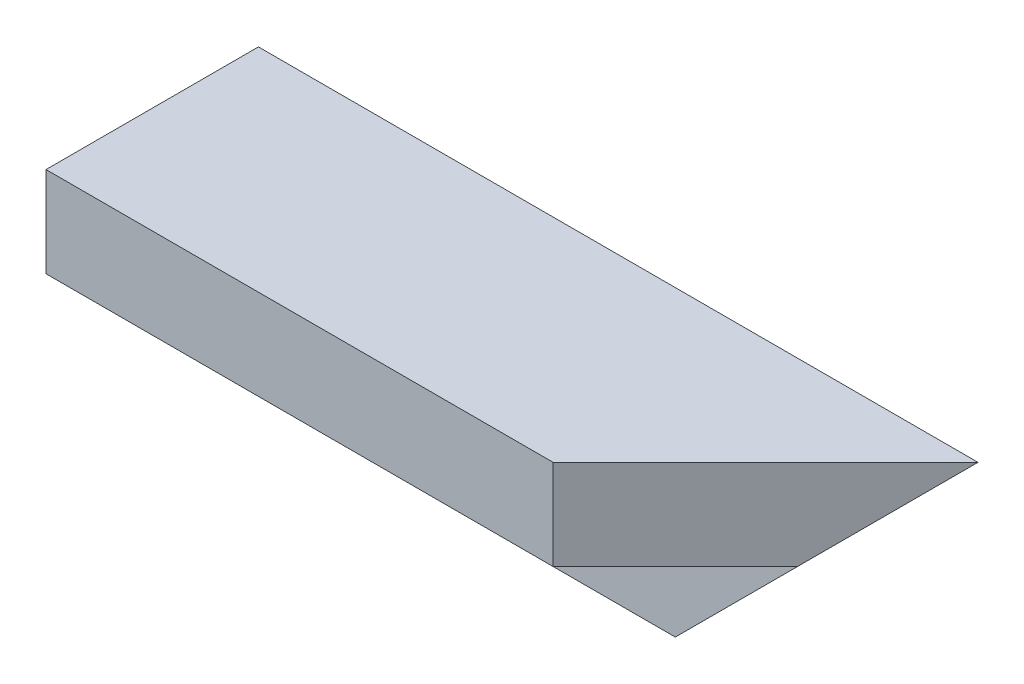
ISO-10303-21;
HEADER;
FILE_DESCRIPTION(('STEP AP214'),'2;1');
FILE_NAME('part.step','',(''),(''),'','','');
FILE_SCHEMA(('AUTOMOTIVE_DESIGN { 1 0 10303 214 1 1 1 1 }'));
ENDSEC;
DATA;
#1=APPLICATION_CONTEXT('core data for automotive mechanical design processes');
#2=APPLICATION_PROTOCOL_DEFINITION('international standard','automotive_design',2000,#1);
#3=PRODUCT_CONTEXT('',#1,'mechanical');
#4=PRODUCT('Part','Part','',(#3));
#5=PRODUCT_RELATED_PRODUCT_CATEGORY('part','',(#4));
#6=PRODUCT_DEFINITION_FORMATION('','',#4);
#7=PRODUCT_DEFINITION_CONTEXT('part definition',#1,'design');
#8=PRODUCT_DEFINITION('design','',#6,#7);
#9=PRODUCT_DEFINITION_SHAPE('','',#8);
#10=(LENGTH_UNIT() NAMED_UNIT(*) SI_UNIT(.MILLI.,.METRE.));
#11=(NAMED_UNIT(*) PLANE_ANGLE_UNIT() SI_UNIT($,.RADIAN.));
#12=(NAMED_UNIT(*) SI_UNIT($,.STERADIAN.) SOLID_ANGLE_UNIT());
#13=UNCERTAINTY_MEASURE_WITH_UNIT(LENGTH_MEASURE(1.E-05),#10,'distance_accuracy_value','');
#14=(GEOMETRIC_REPRESENTATION_CONTEXT(3) GLOBAL_UNCERTAINTY_ASSIGNED_CONTEXT((#13)) GLOBAL_UNIT_ASSIGNED_CONTEXT((#10,
#11,#12)) REPRESENTATION_CONTEXT('',''));
#15=CARTESIAN_POINT('',(0.,0.,0.));
#16=DIRECTION('',(0.,0.,1.));
#17=DIRECTION('',(1.,0.,0.));
#18=AXIS2_PLACEMENT_3D('',#15,#16,#17);
#19=CARTESIAN_POINT('',(222.000000000001,-40.,0.));
#20=DIRECTION('',(0.,0.,1.));
#21=DIRECTION('',(1.,0.,0.));
#22=AXIS2_PLACEMENT_3D('',#19,#20,#21);
#23=PLANE('',#22);
#24=DIRECTION('',(-1.,0.,0.));
#25=VECTOR('',#24,1.);
#26=CARTESIAN_POINT('',(222.000000000001,0.,0.));
#27=LINE('',#26,#25);
#28=CARTESIAN_POINT('',(222.,0.,0.));
#29=VERTEX_POINT('',#28);
#30=CARTESIAN_POINT('',(86.4999999999614,0.,0.));
#31=VERTEX_POINT('',#30);
#32=EDGE_CURVE('E40',#29,#31,#27,.T.);
#33=ORIENTED_EDGE('',*,*,#32,.F.);
#34=DIRECTION('',(0.707106781186548,0.707106781186547,0.));
#35=VECTOR('',#34,1.);
#36=CARTESIAN_POINT('',(222.,0.,0.));
#37=LINE('',#36,#35);
#38=CARTESIAN_POINT('',(182.,-40.,0.));
#39=VERTEX_POINT('',#38);
#40=EDGE_CURVE('E88',#39,#29,#37,.T.);
#41=ORIENTED_EDGE('',*,*,#40,.F.);
#42=DIRECTION('',(-1.,0.,0.));
#43=VECTOR('',#42,1.);
#44=CARTESIAN_POINT('',(222.000000000001,-40.,0.));
#45=LINE('',#44,#43);
#46=CARTESIAN_POINT('',(86.4999999999614,-40.,0.));
#47=VERTEX_POINT('',#46);
#48=EDGE_CURVE('E47',#39,#47,#45,.T.);
#49=ORIENTED_EDGE('',*,*,#48,.T.);
#50=DIRECTION('',(0.,1.,0.));
#51=VECTOR('',#50,1.);
#52=CARTESIAN_POINT('',(86.4999999999614,-40.,0.));
#53=LINE('',#52,#51);
#54=EDGE_CURVE('E118',#47,#31,#53,.T.);
#55=ORIENTED_EDGE('',*,*,#54,.T.);
#56=EDGE_LOOP('',(#33,#41,#49,#55));
#57=FACE_BOUND('',#56,.T.);
#58=ADVANCED_FACE('F33',(#57),#23,.F.);
#59=CARTESIAN_POINT('',(222.000000000001,0.,0.));
#60=DIRECTION('',(0.,-1.,0.));
#61=DIRECTION('',(0.,0.,-1.));
#62=AXIS2_PLACEMENT_3D('',#59,#60,#61);
#63=PLANE('',#62);
#64=DIRECTION('',(-1.,0.,0.));
#65=VECTOR('',#64,1.);
#66=CARTESIAN_POINT('',(222.000000000001,0.,40.));
#67=LINE('',#66,#65);
#68=CARTESIAN_POINT('',(182.,0.,40.));
#69=VERTEX_POINT('',#68);
#70=CARTESIAN_POINT('',(86.4999999999614,0.,40.));
#71=VERTEX_POINT('',#70);
#72=EDGE_CURVE('E109',#69,#71,#67,.T.);
#73=ORIENTED_EDGE('',*,*,#72,.F.);
#74=DIRECTION('',(-0.707106781186548,0.,0.707106781186547));
#75=VECTOR('',#74,1.);
#76=CARTESIAN_POINT('',(222.,0.,0.));
#77=LINE('',#76,#75);
#78=EDGE_CURVE('E117',#29,#69,#77,.T.);
#79=ORIENTED_EDGE('',*,*,#78,.F.);
#80=ORIENTED_EDGE('',*,*,#32,.T.);
#81=DIRECTION('',(0.,0.,1.));
#82=VECTOR('',#81,1.);
#83=CARTESIAN_POINT('',(86.4999999999614,0.,0.));
#84=LINE('',#83,#82);
#85=EDGE_CURVE('E115',#31,#71,#84,.T.);
#86=ORIENTED_EDGE('',*,*,#85,.T.);
#87=EDGE_LOOP('',(#73,#79,#80,#86));
#88=FACE_BOUND('',#87,.T.);
#89=ADVANCED_FACE('F114',(#88),#63,.F.);
#90=CARTESIAN_POINT('',(222.000000000001,0.,40.));
#91=DIRECTION('',(0.,0.,-1.));
#92=DIRECTION('',(-1.,0.,0.));
#93=AXIS2_PLACEMENT_3D('',#90,#91,#92);
#94=PLANE('',#93);
#95=DIRECTION('',(-1.,0.,0.));
#96=VECTOR('',#95,1.);
#97=CARTESIAN_POINT('',(222.000000000001,-17.,40.));
#98=LINE('',#97,#96);
#99=CARTESIAN_POINT('',(182.,-17.,40.));
#100=VERTEX_POINT('',#99);
#101=CARTESIAN_POINT('',(86.4999999999614,-17.,40.));
#102=VERTEX_POINT('',#101);
#103=EDGE_CURVE('E107',#100,#102,#98,.T.);
#104=ORIENTED_EDGE('',*,*,#103,.F.);
#105=DIRECTION('',(0.,1.,0.));
#106=VECTOR('',#105,1.);
#107=CARTESIAN_POINT('',(182.,-40.,40.));
#108=LINE('',#107,#106);
#109=EDGE_CURVE('E125',#100,#69,#108,.T.);
#110=ORIENTED_EDGE('',*,*,#109,.T.);
#111=ORIENTED_EDGE('',*,*,#72,.T.);
#112=DIRECTION('',(0.,-1.,0.));
#113=VECTOR('',#112,1.);
#114=CARTESIAN_POINT('',(86.4999999999614,0.,40.));
#115=LINE('',#114,#113);
#116=EDGE_CURVE('E122',#71,#102,#115,.T.);
#117=ORIENTED_EDGE('',*,*,#116,.T.);
#118=EDGE_LOOP('',(#104,#110,#111,#117));
#119=FACE_BOUND('',#118,.T.);
#120=ADVANCED_FACE('F153',(#119),#94,.F.);
#121=CARTESIAN_POINT('',(222.000000000001,-17.,40.));
#122=DIRECTION('',(0.,1.,0.));
#123=DIRECTION('',(0.,0.,1.));
#124=AXIS2_PLACEMENT_3D('',#121,#122,#123);
#125=PLANE('',#124);
#126=DIRECTION('',(-1.,0.,0.));
#127=VECTOR('',#126,1.);
#128=CARTESIAN_POINT('',(222.000000000001,-17.,17.));
#129=LINE('',#128,#127);
#130=CARTESIAN_POINT('',(205.,-17.,17.));
#131=VERTEX_POINT('',#130);
#132=CARTESIAN_POINT('',(86.4999999999614,-17.,17.));
#133=VERTEX_POINT('',#132);
#134=EDGE_CURVE('E100',#131,#133,#129,.T.);
#135=ORIENTED_EDGE('',*,*,#134,.F.);
#136=DIRECTION('',(-0.707106781186548,0.,0.707106781186548));
#137=VECTOR('',#136,1.);
#138=CARTESIAN_POINT('',(202.,-17.,19.9999999999997));
#139=LINE('',#138,#137);
#140=EDGE_CURVE('E120',#131,#100,#139,.T.);
#141=ORIENTED_EDGE('',*,*,#140,.T.);
#142=ORIENTED_EDGE('',*,*,#103,.T.);
#143=DIRECTION('',(0.,0.,-1.));
#144=VECTOR('',#143,1.);
#145=CARTESIAN_POINT('',(86.4999999999614,-17.,40.));
#146=LINE('',#145,#144);
#147=EDGE_CURVE('E131',#102,#133,#146,.T.);
#148=ORIENTED_EDGE('',*,*,#147,.T.);
#149=EDGE_LOOP('',(#135,#141,#142,#148));
#150=FACE_BOUND('',#149,.T.);
#151=ADVANCED_FACE('F157',(#150),#125,.F.);
#152=CARTESIAN_POINT('',(222.000000000001,-17.,17.));
#153=DIRECTION('',(0.,0.,-1.));
#154=DIRECTION('',(0.,1.,0.));
#155=AXIS2_PLACEMENT_3D('',#152,#153,#154);
#156=PLANE('',#155);
#157=DIRECTION('',(-1.,0.,0.));
#158=VECTOR('',#157,1.);
#159=CARTESIAN_POINT('',(222.000000000001,-40.,17.));
#160=LINE('',#159,#158);
#161=CARTESIAN_POINT('',(182.,-40.,17.));
#162=VERTEX_POINT('',#161);
#163=CARTESIAN_POINT('',(86.4999999999614,-40.,17.));
#164=VERTEX_POINT('',#163);
#165=EDGE_CURVE('E54',#162,#164,#160,.T.);
#166=ORIENTED_EDGE('',*,*,#165,.F.);
#167=DIRECTION('',(0.707106781186548,0.707106781186547,0.));
#168=VECTOR('',#167,1.);
#169=CARTESIAN_POINT('',(213.5,-8.49999999999972,17.));
#170=LINE('',#169,#168);
#171=EDGE_CURVE('E90',#162,#131,#170,.T.);
#172=ORIENTED_EDGE('',*,*,#171,.T.);
#173=ORIENTED_EDGE('',*,*,#134,.T.);
#174=DIRECTION('',(0.,-1.,0.));
#175=VECTOR('',#174,1.);
#176=CARTESIAN_POINT('',(86.4999999999614,-17.,17.));
#177=LINE('',#176,#175);
#178=EDGE_CURVE('E102',#133,#164,#177,.T.);
#179=ORIENTED_EDGE('',*,*,#178,.T.);
#180=EDGE_LOOP('',(#166,#172,#173,#179));
#181=FACE_BOUND('',#180,.T.);
#182=ADVANCED_FACE('F135',(#181),#156,.F.);
#183=CARTESIAN_POINT('',(222.000000000001,-40.,17.));
#184=DIRECTION('',(0.,1.,0.));
#185=DIRECTION('',(0.,0.,1.));
#186=AXIS2_PLACEMENT_3D('',#183,#184,#185);
#187=PLANE('',#186);
#188=ORIENTED_EDGE('',*,*,#48,.F.);
#189=DIRECTION('',(0.,0.,-1.));
#190=VECTOR('',#189,1.);
#191=CARTESIAN_POINT('',(182.,-40.,40.));
#192=LINE('',#191,#190);
#193=EDGE_CURVE('E86',#162,#39,#192,.T.);
#194=ORIENTED_EDGE('',*,*,#193,.F.);
#195=ORIENTED_EDGE('',*,*,#165,.T.);
#196=DIRECTION('',(0.,0.,-1.));
#197=VECTOR('',#196,1.);
#198=CARTESIAN_POINT('',(86.4999999999614,-40.,17.));
#199=LINE('',#198,#197);
#200=EDGE_CURVE('E97',#164,#47,#199,.T.);
#201=ORIENTED_EDGE('',*,*,#200,.T.);
#202=EDGE_LOOP('',(#188,#194,#195,#201));
#203=FACE_BOUND('',#202,.T.);
#204=ADVANCED_FACE('F95',(#203),#187,.F.);
#205=CARTESIAN_POINT('',(86.4999999999614,0.,0.));
#206=DIRECTION('',(1.,0.,0.));
#207=DIRECTION('',(0.,0.,-1.));
#208=AXIS2_PLACEMENT_3D('',#205,#206,#207);
#209=PLANE('',#208);
#210=ORIENTED_EDGE('',*,*,#54,.F.);
#211=ORIENTED_EDGE('',*,*,#200,.F.);
#212=ORIENTED_EDGE('',*,*,#178,.F.);
#213=ORIENTED_EDGE('',*,*,#147,.F.);
#214=ORIENTED_EDGE('',*,*,#116,.F.);
#215=ORIENTED_EDGE('',*,*,#85,.F.);
#216=EDGE_LOOP('',(#210,#211,#212,#213,#214,#215));
#217=FACE_BOUND('',#216,.T.);
#218=ADVANCED_FACE('F138',(#217),#209,.F.);
#219=CARTESIAN_POINT('',(222.,-40.,0.));
#220=DIRECTION('',(-0.707106781186548,0.,-0.707106781186548));
#221=DIRECTION('',(-0.707106781186548,0.,0.707106781186548));
#222=AXIS2_PLACEMENT_3D('',#219,#220,#221);
#223=PLANE('',#222);
#224=ORIENTED_EDGE('',*,*,#140,.F.);
#225=DIRECTION('',(0.577350269189626,0.577350269189626,-0.577350269189626));
#226=VECTOR('',#225,1.);
#227=CARTESIAN_POINT('',(208.666666666667,-13.3333333333333,13.3333333333333));
#228=LINE('',#227,#226);
#229=EDGE_CURVE('E11',#131,#29,#228,.T.);
#230=ORIENTED_EDGE('',*,*,#229,.T.);
#231=ORIENTED_EDGE('',*,*,#78,.T.);
#232=ORIENTED_EDGE('',*,*,#109,.F.);
#233=EDGE_LOOP('',(#224,#230,#231,#232));
#234=FACE_BOUND('',#233,.T.);
#235=ADVANCED_FACE('F140',(#234),#223,.F.);
#236=CARTESIAN_POINT('',(222.,0.,40.));
#237=DIRECTION('',(-0.707106781186547,0.707106781186548,0.));
#238=DIRECTION('',(-0.707106781186548,-0.707106781186547,0.));
#239=AXIS2_PLACEMENT_3D('',#236,#237,#238);
#240=PLANE('',#239);
#241=ORIENTED_EDGE('',*,*,#193,.T.);
#242=ORIENTED_EDGE('',*,*,#40,.T.);
#243=ORIENTED_EDGE('',*,*,#229,.F.);
#244=ORIENTED_EDGE('',*,*,#171,.F.);
#245=EDGE_LOOP('',(#241,#242,#243,#244));
#246=FACE_BOUND('',#245,.T.);
#247=ADVANCED_FACE('F87',(#246),#240,.F.);
#248=CLOSED_SHELL('',(#58,#89,#120,#151,#182,#204,#218,#235,#247));
#249=MANIFOLD_SOLID_BREP('B2',#248);
#250=ADVANCED_BREP_SHAPE_REPRESENTATION('',(#18,#249),#14);
#251=SHAPE_DEFINITION_REPRESENTATION(#9,#250);
ENDSEC;
END-ISO-10303-21;
